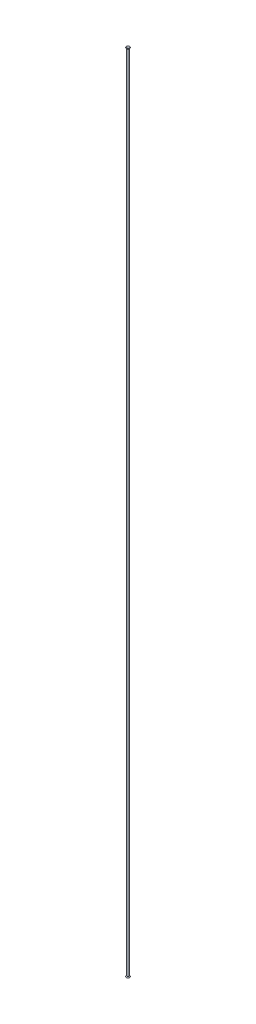
ISO-10303-21;
HEADER;
FILE_DESCRIPTION(('STEP AP214'),'2;1');
FILE_NAME('part.step','',(''),(''),'','','');
FILE_SCHEMA(('AUTOMOTIVE_DESIGN { 1 0 10303 214 1 1 1 1 }'));
ENDSEC;
DATA;
#1=APPLICATION_CONTEXT('core data for automotive mechanical design processes');
#2=APPLICATION_PROTOCOL_DEFINITION('international standard','automotive_design',2000,#1);
#3=PRODUCT_CONTEXT('',#1,'mechanical');
#4=PRODUCT('Part','Part','',(#3));
#5=PRODUCT_RELATED_PRODUCT_CATEGORY('part','',(#4));
#6=PRODUCT_DEFINITION_FORMATION('','',#4);
#7=PRODUCT_DEFINITION_CONTEXT('part definition',#1,'design');
#8=PRODUCT_DEFINITION('design','',#6,#7);
#9=PRODUCT_DEFINITION_SHAPE('','',#8);
#10=(LENGTH_UNIT() NAMED_UNIT(*) SI_UNIT(.MILLI.,.METRE.));
#11=(NAMED_UNIT(*) PLANE_ANGLE_UNIT() SI_UNIT($,.RADIAN.));
#12=(NAMED_UNIT(*) SI_UNIT($,.STERADIAN.) SOLID_ANGLE_UNIT());
#13=UNCERTAINTY_MEASURE_WITH_UNIT(LENGTH_MEASURE(1.E-05),#10,'distance_accuracy_value','');
#14=(GEOMETRIC_REPRESENTATION_CONTEXT(3) GLOBAL_UNCERTAINTY_ASSIGNED_CONTEXT((#13)) GLOBAL_UNIT_ASSIGNED_CONTEXT((#10,
#11,#12)) REPRESENTATION_CONTEXT('',''));
#15=CARTESIAN_POINT('',(0.,0.,0.));
#16=DIRECTION('',(0.,0.,1.));
#17=DIRECTION('',(1.,0.,0.));
#18=AXIS2_PLACEMENT_3D('',#15,#16,#17);
#19=CARTESIAN_POINT('',(0.,4705.096,0.));
#20=DIRECTION('',(0.,-1.,0.));
#21=DIRECTION('',(0.,0.,-1.));
#22=AXIS2_PLACEMENT_3D('',#19,#20,#21);
#23=CYLINDRICAL_SURFACE('',#22,6.35);
#24=CARTESIAN_POINT('',(0.,4705.096,0.));
#25=DIRECTION('',(0.,1.,0.));
#26=DIRECTION('',(0.,0.,1.));
#27=AXIS2_PLACEMENT_3D('',#24,#25,#26);
#28=CIRCLE('',#27,6.35);
#29=CARTESIAN_POINT('',(0.,4705.096,6.35));
#30=VERTEX_POINT('',#29);
#31=EDGE_CURVE('E10',#30,#30,#28,.T.);
#32=ORIENTED_EDGE('',*,*,#31,.F.);
#33=EDGE_LOOP('',(#32));
#34=FACE_BOUND('',#33,.T.);
#35=CARTESIAN_POINT('',(0.,0.,0.));
#36=DIRECTION('',(0.,1.,0.));
#37=DIRECTION('',(0.,0.,1.));
#38=AXIS2_PLACEMENT_3D('',#35,#36,#37);
#39=CIRCLE('',#38,6.35);
#40=CARTESIAN_POINT('',(0.,0.,6.35));
#41=VERTEX_POINT('',#40);
#42=EDGE_CURVE('E65',#41,#41,#39,.T.);
#43=ORIENTED_EDGE('',*,*,#42,.T.);
#44=EDGE_LOOP('',(#43));
#45=FACE_BOUND('',#44,.T.);
#46=ADVANCED_FACE('F37',(#34,#45),#23,.T.);
#47=CARTESIAN_POINT('',(0.,4705.096,0.));
#48=DIRECTION('',(0.,-1.,0.));
#49=DIRECTION('',(0.,0.,-1.));
#50=AXIS2_PLACEMENT_3D('',#47,#48,#49);
#51=CYLINDRICAL_SURFACE('',#50,3.175);
#52=CARTESIAN_POINT('',(0.,4705.096,0.));
#53=DIRECTION('',(0.,1.,0.));
#54=DIRECTION('',(0.,0.,1.));
#55=AXIS2_PLACEMENT_3D('',#52,#53,#54);
#56=CIRCLE('',#55,3.17500000000164);
#57=CARTESIAN_POINT('',(0.,4705.096,3.17500000000164));
#58=VERTEX_POINT('',#57);
#59=EDGE_CURVE('E47',#58,#58,#56,.T.);
#60=ORIENTED_EDGE('',*,*,#59,.T.);
#61=EDGE_LOOP('',(#60));
#62=FACE_BOUND('',#61,.T.);
#63=CARTESIAN_POINT('',(0.,0.,0.));
#64=DIRECTION('',(0.,1.,0.));
#65=DIRECTION('',(0.,0.,1.));
#66=AXIS2_PLACEMENT_3D('',#63,#64,#65);
#67=CIRCLE('',#66,3.175);
#68=CARTESIAN_POINT('',(0.,0.,3.175));
#69=VERTEX_POINT('',#68);
#70=EDGE_CURVE('E43',#69,#69,#67,.T.);
#71=ORIENTED_EDGE('',*,*,#70,.F.);
#72=EDGE_LOOP('',(#71));
#73=FACE_BOUND('',#72,.T.);
#74=ADVANCED_FACE('F82',(#62,#73),#51,.F.);
#75=CARTESIAN_POINT('',(0.,4711.52376452171,0.));
#76=DIRECTION('',(0.,1.,0.));
#77=DIRECTION('',(0.,0.,1.));
#78=AXIS2_PLACEMENT_3D('',#75,#76,#77);
#79=CONICAL_SURFACE('',#78,8.56853483946379,0.698131700797582);
#80=ORIENTED_EDGE('',*,*,#59,.F.);
#81=EDGE_LOOP('',(#80));
#82=FACE_BOUND('',#81,.T.);
#83=CARTESIAN_POINT('',(0.,4711.52376452171,0.));
#84=DIRECTION('',(0.,1.,0.));
#85=DIRECTION('',(0.,0.,1.));
#86=AXIS2_PLACEMENT_3D('',#83,#84,#85);
#87=CIRCLE('',#86,8.56853483946379);
#88=CARTESIAN_POINT('',(0.,4711.52376452171,8.56853483946379));
#89=VERTEX_POINT('',#88);
#90=EDGE_CURVE('E51',#89,#89,#87,.T.);
#91=ORIENTED_EDGE('',*,*,#90,.T.);
#92=EDGE_LOOP('',(#91));
#93=FACE_BOUND('',#92,.T.);
#94=ADVANCED_FACE('F87',(#82,#93),#79,.F.);
#95=CARTESIAN_POINT('',(0.,4709.96038221381,0.));
#96=DIRECTION('',(0.,-1.,0.));
#97=DIRECTION('',(0.,0.,-1.));
#98=AXIS2_PLACEMENT_3D('',#95,#96,#97);
#99=CONICAL_SURFACE('',#98,10.4317013215095,0.872664625996952);
#100=ORIENTED_EDGE('',*,*,#90,.F.);
#101=EDGE_LOOP('',(#100));
#102=FACE_BOUND('',#101,.T.);
#103=CARTESIAN_POINT('',(0.,4709.96038221381,0.));
#104=DIRECTION('',(0.,1.,0.));
#105=DIRECTION('',(0.,0.,1.));
#106=AXIS2_PLACEMENT_3D('',#103,#104,#105);
#107=CIRCLE('',#106,10.4317013215095);
#108=CARTESIAN_POINT('',(0.,4709.96038221381,10.4317013215095));
#109=VERTEX_POINT('',#108);
#110=EDGE_CURVE('E56',#109,#109,#107,.T.);
#111=ORIENTED_EDGE('',*,*,#110,.T.);
#112=EDGE_LOOP('',(#111));
#113=FACE_BOUND('',#112,.T.);
#114=ADVANCED_FACE('F92',(#102,#113),#99,.T.);
#115=CARTESIAN_POINT('',(0.,4705.096,0.));
#116=DIRECTION('',(0.,1.,0.));
#117=DIRECTION('',(0.,0.,1.));
#118=AXIS2_PLACEMENT_3D('',#115,#116,#117);
#119=CONICAL_SURFACE('',#118,6.35,0.698131700797686);
#120=ORIENTED_EDGE('',*,*,#110,.F.);
#121=EDGE_LOOP('',(#120));
#122=FACE_BOUND('',#121,.T.);
#123=ORIENTED_EDGE('',*,*,#31,.T.);
#124=EDGE_LOOP('',(#123));
#125=FACE_BOUND('',#124,.T.);
#126=ADVANCED_FACE('F99',(#122,#125),#119,.T.);
#127=CARTESIAN_POINT('',(0.,-6.42776452171301,0.));
#128=DIRECTION('',(0.,-1.,0.));
#129=DIRECTION('',(0.,0.,1.));
#130=AXIS2_PLACEMENT_3D('',#127,#128,#129);
#131=CONICAL_SURFACE('',#130,8.56853483946379,0.698131700797582);
#132=ORIENTED_EDGE('',*,*,#70,.T.);
#133=EDGE_LOOP('',(#132));
#134=FACE_BOUND('',#133,.T.);
#135=CARTESIAN_POINT('',(0.,-6.42776452171301,0.));
#136=DIRECTION('',(0.,1.,0.));
#137=DIRECTION('',(0.,0.,1.));
#138=AXIS2_PLACEMENT_3D('',#135,#136,#137);
#139=CIRCLE('',#138,8.56853483946379);
#140=CARTESIAN_POINT('',(0.,-6.42776452171301,8.56853483946379));
#141=VERTEX_POINT('',#140);
#142=EDGE_CURVE('E59',#141,#141,#139,.T.);
#143=ORIENTED_EDGE('',*,*,#142,.F.);
#144=EDGE_LOOP('',(#143));
#145=FACE_BOUND('',#144,.T.);
#146=ADVANCED_FACE('F78',(#134,#145),#131,.F.);
#147=CARTESIAN_POINT('',(0.,-4.86438221380592,0.));
#148=DIRECTION('',(0.,1.,0.));
#149=DIRECTION('',(0.,0.,-1.));
#150=AXIS2_PLACEMENT_3D('',#147,#148,#149);
#151=CONICAL_SURFACE('',#150,10.4317013215095,0.872664625996952);
#152=ORIENTED_EDGE('',*,*,#142,.T.);
#153=EDGE_LOOP('',(#152));
#154=FACE_BOUND('',#153,.T.);
#155=CARTESIAN_POINT('',(0.,-4.86438221380592,0.));
#156=DIRECTION('',(0.,1.,0.));
#157=DIRECTION('',(0.,0.,1.));
#158=AXIS2_PLACEMENT_3D('',#155,#156,#157);
#159=CIRCLE('',#158,10.4317013215095);
#160=CARTESIAN_POINT('',(0.,-4.86438221380592,10.4317013215095));
#161=VERTEX_POINT('',#160);
#162=EDGE_CURVE('E62',#161,#161,#159,.T.);
#163=ORIENTED_EDGE('',*,*,#162,.F.);
#164=EDGE_LOOP('',(#163));
#165=FACE_BOUND('',#164,.T.);
#166=ADVANCED_FACE('F72',(#154,#165),#151,.T.);
#167=CARTESIAN_POINT('',(0.,0.,0.));
#168=DIRECTION('',(0.,-1.,0.));
#169=DIRECTION('',(0.,0.,1.));
#170=AXIS2_PLACEMENT_3D('',#167,#168,#169);
#171=CONICAL_SURFACE('',#170,6.35,0.698131700797686);
#172=ORIENTED_EDGE('',*,*,#162,.T.);
#173=EDGE_LOOP('',(#172));
#174=FACE_BOUND('',#173,.T.);
#175=ORIENTED_EDGE('',*,*,#42,.F.);
#176=EDGE_LOOP('',(#175));
#177=FACE_BOUND('',#176,.T.);
#178=ADVANCED_FACE('F70',(#174,#177),#171,.T.);
#179=CLOSED_SHELL('',(#46,#74,#94,#114,#126,#146,#166,#178));
#180=MANIFOLD_SOLID_BREP('B2',#179);
#181=ADVANCED_BREP_SHAPE_REPRESENTATION('',(#18,#180),#14);
#182=SHAPE_DEFINITION_REPRESENTATION(#9,#181);
ENDSEC;
END-ISO-10303-21;
